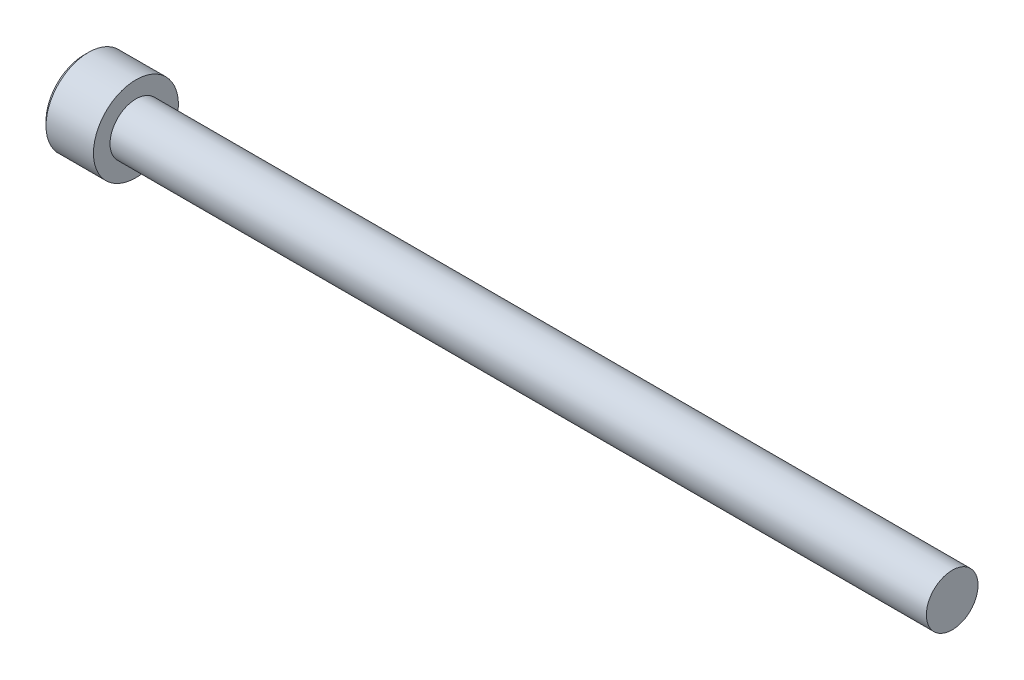
ISO-10303-21;
HEADER;
FILE_DESCRIPTION(('STEP AP214'),'2;1');
FILE_NAME('part.step','',(''),(''),'','','');
FILE_SCHEMA(('AUTOMOTIVE_DESIGN { 1 0 10303 214 1 1 1 1 }'));
ENDSEC;
DATA;
#1=APPLICATION_CONTEXT('core data for automotive mechanical design processes');
#2=APPLICATION_PROTOCOL_DEFINITION('international standard','automotive_design',2000,#1);
#3=PRODUCT_CONTEXT('',#1,'mechanical');
#4=PRODUCT('Part','Part','',(#3));
#5=PRODUCT_RELATED_PRODUCT_CATEGORY('part','',(#4));
#6=PRODUCT_DEFINITION_FORMATION('','',#4);
#7=PRODUCT_DEFINITION_CONTEXT('part definition',#1,'design');
#8=PRODUCT_DEFINITION('design','',#6,#7);
#9=PRODUCT_DEFINITION_SHAPE('','',#8);
#10=(LENGTH_UNIT() NAMED_UNIT(*) SI_UNIT(.MILLI.,.METRE.));
#11=(NAMED_UNIT(*) PLANE_ANGLE_UNIT() SI_UNIT($,.RADIAN.));
#12=(NAMED_UNIT(*) SI_UNIT($,.STERADIAN.) SOLID_ANGLE_UNIT());
#13=UNCERTAINTY_MEASURE_WITH_UNIT(LENGTH_MEASURE(1.E-05),#10,'distance_accuracy_value','');
#14=(GEOMETRIC_REPRESENTATION_CONTEXT(3) GLOBAL_UNCERTAINTY_ASSIGNED_CONTEXT((#13)) GLOBAL_UNIT_ASSIGNED_CONTEXT((#10,
#11,#12)) REPRESENTATION_CONTEXT('',''));
#15=CARTESIAN_POINT('',(0.,0.,0.));
#16=DIRECTION('',(0.,0.,1.));
#17=DIRECTION('',(1.,0.,0.));
#18=AXIS2_PLACEMENT_3D('',#15,#16,#17);
#19=CARTESIAN_POINT('',(-2.28600000000007,-1.14567944042317,1.984375));
#20=DIRECTION('',(0.,0.,1.));
#21=DIRECTION('',(1.,0.,0.));
#22=AXIS2_PLACEMENT_3D('',#19,#20,#21);
#23=PLANE('',#22);
#24=CARTESIAN_POINT('',(-4.82599999995852,1.14567944044653,1.98437499999554));
#25=CARTESIAN_POINT('',(-4.78691618362732,1.06743880343266,1.9843749999984));
#26=CARTESIAN_POINT('',(-4.75011447684892,0.987898318960917,1.98437499999957));
#27=CARTESIAN_POINT('',(-4.68265620500518,0.825677042028778,1.98437500000043));
#28=CARTESIAN_POINT('',(-4.65204056061138,0.742979382529199,1.98437500000012));
#29=CARTESIAN_POINT('',(-4.5991739228306,0.575193959555969,1.98437499999988));
#30=CARTESIAN_POINT('',(-4.57689462080725,0.490115359117279,1.98437499999997));
#31=CARTESIAN_POINT('',(-4.54259467221837,0.318093091130193,1.98437500000003));
#32=CARTESIAN_POINT('',(-4.5305423022885,0.231156054976726,1.984375));
#33=CARTESIAN_POINT('',(-4.52249110263747,0.119918521511051,1.984375));
#34=CARTESIAN_POINT('',(-4.52118947557477,0.0959468443046798,1.984375));
#35=CARTESIAN_POINT('',(-4.51945182629813,0.0479845644411998,1.984375));
#36=CARTESIAN_POINT('',(-4.51901533386223,0.0239939791589393,1.984375));
#37=CARTESIAN_POINT('',(-4.51901809008399,-0.0602201717457363,1.984375));
#38=CARTESIAN_POINT('',(-4.52177452299902,-0.120461721905447,1.984375));
#39=CARTESIAN_POINT('',(-4.5326365512493,-0.240474970989197,1.984375));
#40=CARTESIAN_POINT('',(-4.54074587749718,-0.300246312758427,1.984375));
#41=CARTESIAN_POINT('',(-4.57259622946939,-0.478763752804282,1.984375));
#42=CARTESIAN_POINT('',(-4.60385422611702,-0.596208828937734,1.984375));
#43=CARTESIAN_POINT('',(-4.66780003592237,-0.785921487441256,1.984375));
#44=CARTESIAN_POINT('',(-4.69623457768558,-0.859734609866899,1.984375));
#45=CARTESIAN_POINT('',(-4.75786140400812,-1.00456595519282,1.984375));
#46=CARTESIAN_POINT('',(-4.79100779300359,-1.07560356657101,1.984375));
#47=CARTESIAN_POINT('',(-4.82599999995643,-1.14567944044724,1.984375));
#48=B_SPLINE_CURVE_WITH_KNOTS('',3,(#24,#25,#26,#27,#28,#29,#30,#31,#32,#33,#34,#35,#36,#37,#38,
#39,#40,#41,#42,#43,#44,#45,#46,#47),.UNSPECIFIED.,.F.,.F.,(4,2,2,2,2,2,2,2,2,2,2,4),(0.,
0.262559005207405,0.526801735838036,0.790138824405318,1.05265603861765,1.12466619182083,
1.19663719499031,1.3772702672652,1.55802937209382,1.92104085090328,2.15819130092264,
2.39317265078575),.UNSPECIFIED.);
#49=CARTESIAN_POINT('',(-4.82599999996829,1.14567944041753,1.98437500003084));
#50=VERTEX_POINT('',#49);
#51=CARTESIAN_POINT('',(-4.8259999999622,-1.14567944043207,1.98437500001542));
#52=VERTEX_POINT('',#51);
#53=EDGE_CURVE('E20',#50,#52,#48,.T.);
#54=ORIENTED_EDGE('',*,*,#53,.F.);
#55=DIRECTION('',(1.,0.,0.));
#56=VECTOR('',#55,1.);
#57=CARTESIAN_POINT('',(-2.28600000000007,1.14567944042316,1.984375));
#58=LINE('',#57,#56);
#59=CARTESIAN_POINT('',(-2.28600000000007,1.14567944042316,1.984375));
#60=VERTEX_POINT('',#59);
#61=EDGE_CURVE('E68',#50,#60,#58,.T.);
#62=ORIENTED_EDGE('',*,*,#61,.T.);
#63=DIRECTION('',(0.,1.,0.));
#64=VECTOR('',#63,1.);
#65=CARTESIAN_POINT('',(-2.28600000000007,0.,1.984375));
#66=LINE('',#65,#64);
#67=CARTESIAN_POINT('',(-2.28600000000007,-1.14567944042317,1.984375));
#68=VERTEX_POINT('',#67);
#69=EDGE_CURVE('E74',#68,#60,#66,.T.);
#70=ORIENTED_EDGE('',*,*,#69,.F.);
#71=DIRECTION('',(1.,0.,0.));
#72=VECTOR('',#71,1.);
#73=CARTESIAN_POINT('',(-2.28600000000007,-1.14567944042317,1.984375));
#74=LINE('',#73,#72);
#75=EDGE_CURVE('E71',#68,#52,#74,.F.);
#76=ORIENTED_EDGE('',*,*,#75,.T.);
#77=EDGE_LOOP('',(#54,#62,#70,#76));
#78=FACE_BOUND('',#77,.T.);
#79=ADVANCED_FACE('F16',(#78),#23,.F.);
#80=CARTESIAN_POINT('',(-2.28600000000007,0.,0.));
#81=DIRECTION('',(-1.,0.,0.));
#82=DIRECTION('',(0.,0.,1.));
#83=AXIS2_PLACEMENT_3D('',#80,#81,#82);
#84=PLANE('',#83);
#85=DIRECTION('',(0.,0.5,0.866025403784439));
#86=VECTOR('',#85,1.);
#87=CARTESIAN_POINT('',(-2.28600000000007,2.29135888084633,0.));
#88=LINE('',#87,#86);
#89=CARTESIAN_POINT('',(-2.28600000000007,2.29135888084633,0.));
#90=VERTEX_POINT('',#89);
#91=CARTESIAN_POINT('',(-2.28600000000007,1.14567944042316,-1.984375));
#92=VERTEX_POINT('',#91);
#93=EDGE_CURVE('E82',#90,#92,#88,.F.);
#94=ORIENTED_EDGE('',*,*,#93,.T.);
#95=DIRECTION('',(0.,1.,0.));
#96=VECTOR('',#95,1.);
#97=CARTESIAN_POINT('',(-2.28600000000007,1.14567944042316,-1.984375));
#98=LINE('',#97,#96);
#99=CARTESIAN_POINT('',(-2.28600000000007,-1.14567944042316,-1.984375));
#100=VERTEX_POINT('',#99);
#101=EDGE_CURVE('E242',#92,#100,#98,.F.);
#102=ORIENTED_EDGE('',*,*,#101,.T.);
#103=DIRECTION('',(0.,0.5,-0.866025403784439));
#104=VECTOR('',#103,1.);
#105=CARTESIAN_POINT('',(-2.28600000000007,-1.14567944042316,-1.984375));
#106=LINE('',#105,#104);
#107=CARTESIAN_POINT('',(-2.28600000000007,-2.29135888084633,0.));
#108=VERTEX_POINT('',#107);
#109=EDGE_CURVE('E227',#100,#108,#106,.F.);
#110=ORIENTED_EDGE('',*,*,#109,.T.);
#111=DIRECTION('',(0.,-0.5,-0.866025403784439));
#112=VECTOR('',#111,1.);
#113=CARTESIAN_POINT('',(-2.28600000000007,-2.29135888084633,0.));
#114=LINE('',#113,#112);
#115=EDGE_CURVE('E224',#108,#68,#114,.F.);
#116=ORIENTED_EDGE('',*,*,#115,.T.);
#117=ORIENTED_EDGE('',*,*,#69,.T.);
#118=DIRECTION('',(0.,-0.5,0.866025403784439));
#119=VECTOR('',#118,1.);
#120=CARTESIAN_POINT('',(-2.28600000000007,1.14567944042316,1.984375));
#121=LINE('',#120,#119);
#122=EDGE_CURVE('E81',#60,#90,#121,.F.);
#123=ORIENTED_EDGE('',*,*,#122,.T.);
#124=EDGE_LOOP('',(#94,#102,#110,#116,#117,#123));
#125=FACE_BOUND('',#124,.T.);
#126=ADVANCED_FACE('F160',(#125),#84,.T.);
#127=CARTESIAN_POINT('',(-2.28600000000007,-1.14567944042316,-1.984375));
#128=DIRECTION('',(0.,-0.866025403784439,-0.5));
#129=DIRECTION('',(0.,0.5,-0.866025403784439));
#130=AXIS2_PLACEMENT_3D('',#127,#128,#129);
#131=PLANE('',#130);
#132=CARTESIAN_POINT('',(-4.82599999995871,-1.14567944040756,-1.98437500001887));
#133=CARTESIAN_POINT('',(-4.78666022792997,-1.18505700230148,-1.91617106214563));
#134=CARTESIAN_POINT('',(-4.74963132844072,-1.22509295783734,-1.8468267530301));
#135=CARTESIAN_POINT('',(-4.68183299424977,-1.30673037975396,-1.70542659047317));
#136=CARTESIAN_POINT('',(-4.65110127019237,-1.34833960561553,-1.63335729721673));
#137=CARTESIAN_POINT('',(-4.59845762010516,-1.432242568594,-1.48803310243203));
#138=CARTESIAN_POINT('',(-4.57641341195893,-1.47451494967301,-1.41481519064643));
#139=CARTESIAN_POINT('',(-4.54245011067441,-1.55999007976842,-1.26676792253773));
#140=CARTESIAN_POINT('',(-4.53050567471972,-1.6031902195197,-1.19194308559438));
#141=CARTESIAN_POINT('',(-4.51972842752365,-1.67764765054852,-1.06297903205139));
#142=CARTESIAN_POINT('',(-4.51813352794834,-1.70880881707173,-1.00900630841009));
#143=CARTESIAN_POINT('',(-4.52082392138599,-1.77108016542046,-0.901149169214274));
#144=CARTESIAN_POINT('',(-4.52511127545884,-1.80219032554946,-0.847264791239237));
#145=CARTESIAN_POINT('',(-4.53932219421538,-1.86411684097343,-0.740004920189235));
#146=CARTESIAN_POINT('',(-4.54925206045723,-1.8949328285454,-0.686630064029166));
#147=CARTESIAN_POINT('',(-4.5742029484467,-1.95603190279815,-0.580803363127978));
#148=CARTESIAN_POINT('',(-4.58922357974385,-1.98631503016081,-0.528351447923769));
#149=CARTESIAN_POINT('',(-4.63380478900425,-2.06386502548479,-0.394030915895904));
#150=CARTESIAN_POINT('',(-4.66672213384104,-2.11065153226583,-0.312994309042484));
#151=CARTESIAN_POINT('',(-4.72228952038986,-2.17944749410732,-0.193836207777459));
#152=CARTESIAN_POINT('',(-4.74181309375939,-2.20211890802843,-0.154568166986659));
#153=CARTESIAN_POINT('',(-4.78263970065987,-2.24704195201531,-0.0767591723707469));
#154=CARTESIAN_POINT('',(-4.80394164363173,-2.2692938292399,-0.0382177904539708));
#155=CARTESIAN_POINT('',(-4.82599999995675,-2.29135888085868,2.13931096265935E-11));
#156=B_SPLINE_CURVE_WITH_KNOTS('',3,(#132,#133,#134,#135,#136,#137,#138,#139,#140,#141,#142,
#143,#144,#145,#146,#147,#148,#149,#150,#151,#152,#153,#154,#155),.UNSPECIFIED.,.F.,.F.,(4,2,2,
2,2,2,2,2,2,2,2,4),(0.,0.264284909626495,0.530108996358094,0.791712695414128,1.05265800174404,
1.23942150116703,1.42625045663858,1.61328847394198,1.80031214908683,2.09727151182814,
2.24534838946042,2.39333511890876),.UNSPECIFIED.);
#157=CARTESIAN_POINT('',(-4.8259999999622,-1.14567944043207,-1.98437500001542));
#158=VERTEX_POINT('',#157);
#159=CARTESIAN_POINT('',(-4.82599999996846,-2.2913588808704,-2.00043543490866E-11));
#160=VERTEX_POINT('',#159);
#161=EDGE_CURVE('E162',#158,#160,#156,.T.);
#162=ORIENTED_EDGE('',*,*,#161,.T.);
#163=DIRECTION('',(1.,0.,0.));
#164=VECTOR('',#163,1.);
#165=CARTESIAN_POINT('',(-2.28600000000007,-2.29135888084633,0.));
#166=LINE('',#165,#164);
#167=EDGE_CURVE('E235',#160,#108,#166,.T.);
#168=ORIENTED_EDGE('',*,*,#167,.T.);
#169=ORIENTED_EDGE('',*,*,#109,.F.);
#170=DIRECTION('',(-1.,0.,0.));
#171=VECTOR('',#170,1.);
#172=CARTESIAN_POINT('',(-2.28600000000007,-1.14567944042316,-1.984375));
#173=LINE('',#172,#171);
#174=EDGE_CURVE('E245',#100,#158,#173,.T.);
#175=ORIENTED_EDGE('',*,*,#174,.T.);
#176=EDGE_LOOP('',(#162,#168,#169,#175));
#177=FACE_BOUND('',#176,.T.);
#178=ADVANCED_FACE('F156',(#177),#131,.F.);
#179=CARTESIAN_POINT('',(-2.28600000000007,-2.29135888084633,0.));
#180=DIRECTION('',(0.,-0.866025403784439,0.5));
#181=DIRECTION('',(0.,-0.5,-0.866025403784439));
#182=AXIS2_PLACEMENT_3D('',#179,#180,#181);
#183=PLANE('',#182);
#184=CARTESIAN_POINT('',(-4.8259999999587,-2.29135888085486,-2.29477011545215E-11));
#185=CARTESIAN_POINT('',(-4.78666022792997,-2.25198131896546,0.0682039378529047));
#186=CARTESIAN_POINT('',(-4.74963132844072,-2.21194536343147,0.137548246969502));
#187=CARTESIAN_POINT('',(-4.68183299424977,-2.13030794151622,0.278948409527228));
#188=CARTESIAN_POINT('',(-4.65110127019237,-2.08869871565414,0.351017702783377));
#189=CARTESIAN_POINT('',(-4.59845762010516,-2.00479575267531,0.496341897567867));
#190=CARTESIAN_POINT('',(-4.57641341195893,-1.96252337159644,0.569559809353539));
#191=CARTESIAN_POINT('',(-4.5424501106744,-1.87704824150112,0.717607077462299));
#192=CARTESIAN_POINT('',(-4.53050567471972,-1.8338481017498,0.792431914405622));
#193=CARTESIAN_POINT('',(-4.51972842752365,-1.75939067072096,0.921395967948603));
#194=CARTESIAN_POINT('',(-4.51813352794834,-1.72822950419776,0.975368691589913));
#195=CARTESIAN_POINT('',(-4.52082392138599,-1.66595815584903,1.08322583078573));
#196=CARTESIAN_POINT('',(-4.52511127545884,-1.63484799572003,1.13711020876076));
#197=CARTESIAN_POINT('',(-4.53932219421538,-1.57292148029607,1.24437007981077));
#198=CARTESIAN_POINT('',(-4.54925206045723,-1.54210549272409,1.29774493597084));
#199=CARTESIAN_POINT('',(-4.5742029484467,-1.48100641847134,1.40357163687202));
#200=CARTESIAN_POINT('',(-4.58922357974385,-1.45072329110868,1.45602355207623));
#201=CARTESIAN_POINT('',(-4.63380478900421,-1.37317329578476,1.59034408410398));
#202=CARTESIAN_POINT('',(-4.66672213384095,-1.32638678900379,1.6713806909573));
#203=CARTESIAN_POINT('',(-4.72228952038968,-1.25759082716239,1.79053879222216));
#204=CARTESIAN_POINT('',(-4.74181309375917,-1.23491941324131,1.82980683301291));
#205=CARTESIAN_POINT('',(-4.78263970065959,-1.18999636925449,1.90761582762873));
#206=CARTESIAN_POINT('',(-4.8039416436314,-1.16774449202993,1.94615720954545));
#207=CARTESIAN_POINT('',(-4.82599999995639,-1.14567944041117,1.98437500002077));
#208=B_SPLINE_CURVE_WITH_KNOTS('',3,(#184,#185,#186,#187,#188,#189,#190,#191,#192,#193,#194,
#195,#196,#197,#198,#199,#200,#201,#202,#203,#204,#205,#206,#207),.UNSPECIFIED.,.F.,.F.,(4,2,2,
2,2,2,2,2,2,2,2,4),(0.,0.264284909626493,0.530108996358089,0.791712695414125,1.05265800174404,
1.23942150116703,1.42625045663858,1.61328847394198,1.80031214908683,2.09727151182773,
2.24534838945981,2.39333511890795),.UNSPECIFIED.);
#209=EDGE_CURVE('E91',#160,#52,#208,.T.);
#210=ORIENTED_EDGE('',*,*,#209,.T.);
#211=ORIENTED_EDGE('',*,*,#75,.F.);
#212=ORIENTED_EDGE('',*,*,#115,.F.);
#213=ORIENTED_EDGE('',*,*,#167,.F.);
#214=EDGE_LOOP('',(#210,#211,#212,#213));
#215=FACE_BOUND('',#214,.T.);
#216=ADVANCED_FACE('F151',(#215),#183,.F.);
#217=CARTESIAN_POINT('',(-2.28600000000007,1.14567944042316,1.984375));
#218=DIRECTION('',(0.,0.866025403784439,0.5));
#219=DIRECTION('',(0.,-0.5,0.866025403784439));
#220=AXIS2_PLACEMENT_3D('',#217,#218,#219);
#221=PLANE('',#220);
#222=CARTESIAN_POINT('',(-4.82599999995852,1.14567944040762,1.98437500001801));
#223=CARTESIAN_POINT('',(-4.78666022792973,1.1850570023017,1.91617106214498));
#224=CARTESIAN_POINT('',(-4.74963132844047,1.22509295783761,1.84682675302957));
#225=CARTESIAN_POINT('',(-4.68183299424957,1.30673037975422,1.70542659047278));
#226=CARTESIAN_POINT('',(-4.65110127019222,1.34833960561574,1.63335729721638));
#227=CARTESIAN_POINT('',(-4.59845762010509,1.43224256859413,1.48803310243178));
#228=CARTESIAN_POINT('',(-4.57641341195888,1.47451494967311,1.41481519064625));
#229=CARTESIAN_POINT('',(-4.54245011067439,1.55999007976846,1.26676792253767));
#230=CARTESIAN_POINT('',(-4.53050567471972,1.6031902195197,1.19194308559439));
#231=CARTESIAN_POINT('',(-4.51972842752365,1.67764765054848,1.06297903205146));
#232=CARTESIAN_POINT('',(-4.51813352794835,1.70880881707169,1.00900630841016));
#233=CARTESIAN_POINT('',(-4.52082392138598,1.77108016542041,0.901149169214364));
#234=CARTESIAN_POINT('',(-4.52511127545883,1.80219032554941,0.847264791239333));
#235=CARTESIAN_POINT('',(-4.53932219421536,1.86411684097336,0.740004920189342));
#236=CARTESIAN_POINT('',(-4.54925206045721,1.89493282854533,0.686630064029278));
#237=CARTESIAN_POINT('',(-4.57420294844667,1.95603190279808,0.5808033631281));
#238=CARTESIAN_POINT('',(-4.58922357974382,1.98631503016074,0.528351447923897));
#239=CARTESIAN_POINT('',(-4.6338047890042,2.06386502548473,0.394030915896012));
#240=CARTESIAN_POINT('',(-4.666722133841,2.11065153226578,0.312994309042568));
#241=CARTESIAN_POINT('',(-4.72228952038984,2.17944749410729,0.19383620777751));
#242=CARTESIAN_POINT('',(-4.74181309375937,2.20211890802841,0.1545681669867));
#243=CARTESIAN_POINT('',(-4.78263970065986,2.24704195201529,0.0767591723707674));
#244=CARTESIAN_POINT('',(-4.80394164363172,2.26929382923989,0.0382177904539813));
#245=CARTESIAN_POINT('',(-4.82599999995675,2.29135888085868,-2.1392886942985E-11));
#246=B_SPLINE_CURVE_WITH_KNOTS('',3,(#222,#223,#224,#225,#226,#227,#228,#229,#230,#231,#232,
#233,#234,#235,#236,#237,#238,#239,#240,#241,#242,#243,#244,#245),.UNSPECIFIED.,.F.,.F.,(4,2,2,
2,2,2,2,2,2,2,2,4),(0.,0.26428490962629,0.530108996357672,0.791712695413487,1.05265800174319,
1.23942150116616,1.42625045663768,1.61328847394106,1.80031214908589,2.09727151182728,
2.2453483894596,2.39333511890798),.UNSPECIFIED.);
#247=CARTESIAN_POINT('',(-4.82599999996846,2.29135888087039,2.00042061038936E-11));
#248=VERTEX_POINT('',#247);
#249=EDGE_CURVE('E79',#50,#248,#246,.T.);
#250=ORIENTED_EDGE('',*,*,#249,.T.);
#251=DIRECTION('',(1.,0.,0.));
#252=VECTOR('',#251,1.);
#253=CARTESIAN_POINT('',(-2.28600000000007,2.29135888084633,0.));
#254=LINE('',#253,#252);
#255=EDGE_CURVE('E246',#248,#90,#254,.T.);
#256=ORIENTED_EDGE('',*,*,#255,.T.);
#257=ORIENTED_EDGE('',*,*,#122,.F.);
#258=ORIENTED_EDGE('',*,*,#61,.F.);
#259=EDGE_LOOP('',(#250,#256,#257,#258));
#260=FACE_BOUND('',#259,.T.);
#261=ADVANCED_FACE('F76',(#260),#221,.F.);
#262=CARTESIAN_POINT('',(-2.28600000000007,2.29135888084633,0.));
#263=DIRECTION('',(0.,0.866025403784439,-0.5));
#264=DIRECTION('',(0.,0.5,0.866025403784439));
#265=AXIS2_PLACEMENT_3D('',#262,#263,#264);
#266=PLANE('',#265);
#267=CARTESIAN_POINT('',(-4.82599999995871,2.29135888085486,2.29489280696874E-11));
#268=CARTESIAN_POINT('',(-4.78666022792997,2.25198131896547,-0.0682039378529039));
#269=CARTESIAN_POINT('',(-4.74963132844072,2.21194536343147,-0.137548246969502));
#270=CARTESIAN_POINT('',(-4.68183299424977,2.13030794151622,-0.278948409527229));
#271=CARTESIAN_POINT('',(-4.65110127019237,2.08869871565414,-0.351017702783379));
#272=CARTESIAN_POINT('',(-4.59845762010516,2.00479575267531,-0.496341897567869));
#273=CARTESIAN_POINT('',(-4.57641341195893,1.96252337159644,-0.569559809353541));
#274=CARTESIAN_POINT('',(-4.5424501106744,1.87704824150112,-0.7176070774623));
#275=CARTESIAN_POINT('',(-4.53050567471972,1.8338481017498,-0.792431914405622));
#276=CARTESIAN_POINT('',(-4.51972842752365,1.75939067072096,-0.921395967948603));
#277=CARTESIAN_POINT('',(-4.51813352794834,1.72822950419776,-0.975368691589912));
#278=CARTESIAN_POINT('',(-4.52082392138599,1.66595815584903,-1.08322583078573));
#279=CARTESIAN_POINT('',(-4.52511127545884,1.63484799572003,-1.13711020876076));
#280=CARTESIAN_POINT('',(-4.53932219421538,1.57292148029607,-1.24437007981077));
#281=CARTESIAN_POINT('',(-4.54925206045723,1.54210549272409,-1.29774493597083));
#282=CARTESIAN_POINT('',(-4.5742029484467,1.48100641847134,-1.40357163687202));
#283=CARTESIAN_POINT('',(-4.58922357974385,1.45072329110868,-1.45602355207623));
#284=CARTESIAN_POINT('',(-4.63380478900425,1.3731732957847,-1.5903440841041));
#285=CARTESIAN_POINT('',(-4.66672213384104,1.32638678900366,-1.67138069095752));
#286=CARTESIAN_POINT('',(-4.72228952038986,1.25759082716218,-1.79053879222254));
#287=CARTESIAN_POINT('',(-4.74181309375939,1.23491941324106,-1.82980683301334));
#288=CARTESIAN_POINT('',(-4.78263970065987,1.18999636925419,-1.90761582762925));
#289=CARTESIAN_POINT('',(-4.80394164363173,1.1677444920296,-1.94615720954603));
#290=CARTESIAN_POINT('',(-4.82599999995675,1.14567944041081,-1.98437500002139));
#291=B_SPLINE_CURVE_WITH_KNOTS('',3,(#267,#268,#269,#270,#271,#272,#273,#274,#275,#276,#277,
#278,#279,#280,#281,#282,#283,#284,#285,#286,#287,#288,#289,#290),.UNSPECIFIED.,.F.,.F.,(4,2,2,
2,2,2,2,2,2,2,2,4),(0.,0.264284909626495,0.530108996358093,0.791712695414127,1.05265800174404,
1.23942150116703,1.42625045663858,1.61328847394198,1.80031214908683,2.09727151182814,
2.24534838946042,2.39333511890876),.UNSPECIFIED.);
#292=CARTESIAN_POINT('',(-4.82599999996846,1.14567944045252,-1.98437500001084));
#293=VERTEX_POINT('',#292);
#294=EDGE_CURVE('E39',#248,#293,#291,.T.);
#295=ORIENTED_EDGE('',*,*,#294,.T.);
#296=DIRECTION('',(-1.,0.,0.));
#297=VECTOR('',#296,1.);
#298=CARTESIAN_POINT('',(-2.28600000000007,1.14567944042316,-1.984375));
#299=LINE('',#298,#297);
#300=EDGE_CURVE('E166',#293,#92,#299,.F.);
#301=ORIENTED_EDGE('',*,*,#300,.T.);
#302=ORIENTED_EDGE('',*,*,#93,.F.);
#303=ORIENTED_EDGE('',*,*,#255,.F.);
#304=EDGE_LOOP('',(#295,#301,#302,#303));
#305=FACE_BOUND('',#304,.T.);
#306=ADVANCED_FACE('F150',(#305),#266,.F.);
#307=CARTESIAN_POINT('',(-2.28600000000007,1.14567944042316,-1.984375));
#308=DIRECTION('',(0.,0.,-1.));
#309=DIRECTION('',(-1.,0.,0.));
#310=AXIS2_PLACEMENT_3D('',#307,#308,#309);
#311=PLANE('',#310);
#312=CARTESIAN_POINT('',(-4.8259999999587,1.14567944044731,-1.98437499999592));
#313=CARTESIAN_POINT('',(-4.78666022793094,1.06692431665146,-1.98437499999853));
#314=CARTESIAN_POINT('',(-4.74963132844318,0.986852405569011,-1.98437499999961));
#315=CARTESIAN_POINT('',(-4.6818329942566,0.823577561711963,-1.9843750000004));
#316=CARTESIAN_POINT('',(-4.65110127020207,0.740359109975722,-1.98437500000011));
#317=CARTESIAN_POINT('',(-4.59845762012233,0.572553183993917,-1.9843749999999));
#318=CARTESIAN_POINT('',(-4.57641341198063,0.488008421824127,-1.98437499999997));
#319=CARTESIAN_POINT('',(-4.54245011070673,0.317058161610178,-1.98437500000003));
#320=CARTESIAN_POINT('',(-4.53050567475816,0.230657882096267,-1.98437500000001));
#321=CARTESIAN_POINT('',(-4.51972842757294,0.0817430200124032,-1.984375));
#322=CARTESIAN_POINT('',(-4.51813352800283,0.0194206869508218,-1.984375));
#323=CARTESIAN_POINT('',(-4.52082392145254,-0.1051220097764,-1.984375));
#324=CARTESIAN_POINT('',(-4.52511127553227,-0.167342330049008,-1.984375));
#325=CARTESIAN_POINT('',(-4.53932219430377,-0.291195360925477,-1.984375));
#326=CARTESIAN_POINT('',(-4.54925206055372,-0.352827336083362,-1.984375));
#327=CARTESIAN_POINT('',(-4.57420294856008,-0.475025484616114,-1.984375));
#328=CARTESIAN_POINT('',(-4.58922357986604,-0.535591739354747,-1.984375));
#329=CARTESIAN_POINT('',(-4.63380478912724,-0.690691729958653,-1.984375));
#330=CARTESIAN_POINT('',(-4.66672213394715,-0.784264743465576,-1.984375));
#331=CARTESIAN_POINT('',(-4.7222895204619,-0.921856667069616,-1.984375));
#332=CARTESIAN_POINT('',(-4.74181309381856,-0.967199494886089,-1.984375));
#333=CARTESIAN_POINT('',(-4.78263970069104,-1.05704558280959,-1.984375));
#334=CARTESIAN_POINT('',(-4.80394164364776,-1.10154933723428,-1.984375));
#335=CARTESIAN_POINT('',(-4.82599999995675,-1.14567944044787,-1.984375));
#336=B_SPLINE_CURVE_WITH_KNOTS('',3,(#312,#313,#314,#315,#316,#317,#318,#319,#320,#321,#322,
#323,#324,#325,#326,#327,#328,#329,#330,#331,#332,#333,#334,#335),.UNSPECIFIED.,.F.,.F.,(4,2,2,
2,2,2,2,2,2,2,2,4),(0.,0.264284909658836,0.530108996422784,0.791712695509868,1.0526580018708,
1.23942150133878,1.42625045685537,1.61328847420389,1.80031214939384,2.09727151196384,
2.24534838950992,2.39333511887245),.UNSPECIFIED.);
#337=EDGE_CURVE('E108',#293,#158,#336,.T.);
#338=ORIENTED_EDGE('',*,*,#337,.T.);
#339=ORIENTED_EDGE('',*,*,#174,.F.);
#340=ORIENTED_EDGE('',*,*,#101,.F.);
#341=ORIENTED_EDGE('',*,*,#300,.F.);
#342=EDGE_LOOP('',(#338,#339,#340,#341));
#343=FACE_BOUND('',#342,.T.);
#344=ADVANCED_FACE('F121',(#343),#311,.F.);
#345=CARTESIAN_POINT('',(-4.82599999998001,0.,0.));
#346=DIRECTION('',(-1.,0.,0.));
#347=DIRECTION('',(0.,0.,1.));
#348=AXIS2_PLACEMENT_3D('',#345,#346,#347);
#349=CONICAL_SURFACE('',#348,2.29135888088194,0.785398163397448);
#350=ORIENTED_EDGE('',*,*,#161,.F.);
#351=CARTESIAN_POINT('',(-4.82599999998001,0.,0.));
#352=DIRECTION('',(-1.,0.,0.));
#353=DIRECTION('',(0.,0.,1.));
#354=AXIS2_PLACEMENT_3D('',#351,#352,#353);
#355=CIRCLE('',#354,2.29135888088194);
#356=EDGE_CURVE('E105',#158,#160,#355,.T.);
#357=ORIENTED_EDGE('',*,*,#356,.T.);
#358=EDGE_LOOP('',(#350,#357));
#359=FACE_BOUND('',#358,.T.);
#360=ADVANCED_FACE('F167',(#359),#349,.F.);
#361=CARTESIAN_POINT('',(-4.82599999998001,0.,0.));
#362=DIRECTION('',(-1.,0.,0.));
#363=DIRECTION('',(0.,0.,1.));
#364=AXIS2_PLACEMENT_3D('',#361,#362,#363);
#365=CONICAL_SURFACE('',#364,2.29135888088194,0.785398163397448);
#366=ORIENTED_EDGE('',*,*,#209,.F.);
#367=CARTESIAN_POINT('',(-4.82599999998001,0.,0.));
#368=DIRECTION('',(-1.,0.,0.));
#369=DIRECTION('',(0.,0.,1.));
#370=AXIS2_PLACEMENT_3D('',#367,#368,#369);
#371=CIRCLE('',#370,2.29135888088194);
#372=EDGE_CURVE('E86',#160,#52,#371,.T.);
#373=ORIENTED_EDGE('',*,*,#372,.T.);
#374=EDGE_LOOP('',(#366,#373));
#375=FACE_BOUND('',#374,.T.);
#376=ADVANCED_FACE('F170',(#375),#365,.F.);
#377=CARTESIAN_POINT('',(-4.82599999998001,0.,0.));
#378=DIRECTION('',(-1.,0.,0.));
#379=DIRECTION('',(0.,0.,1.));
#380=AXIS2_PLACEMENT_3D('',#377,#378,#379);
#381=CONICAL_SURFACE('',#380,2.29135888088194,0.78539816348948);
#382=CARTESIAN_POINT('',(-4.82599999998001,0.,0.));
#383=DIRECTION('',(-1.,0.,0.));
#384=DIRECTION('',(0.,0.,1.));
#385=AXIS2_PLACEMENT_3D('',#382,#383,#384);
#386=CIRCLE('',#385,2.29135888088194);
#387=EDGE_CURVE('E59',#52,#50,#386,.T.);
#388=ORIENTED_EDGE('',*,*,#387,.T.);
#389=ORIENTED_EDGE('',*,*,#53,.T.);
#390=EDGE_LOOP('',(#388,#389));
#391=FACE_BOUND('',#390,.T.);
#392=ADVANCED_FACE('F84',(#391),#381,.F.);
#393=CARTESIAN_POINT('',(-4.82599999998001,0.,0.));
#394=DIRECTION('',(-1.,0.,0.));
#395=DIRECTION('',(0.,0.,1.));
#396=AXIS2_PLACEMENT_3D('',#393,#394,#395);
#397=CONICAL_SURFACE('',#396,2.29135888088194,0.785398163397448);
#398=ORIENTED_EDGE('',*,*,#249,.F.);
#399=CARTESIAN_POINT('',(-4.82599999998001,0.,0.));
#400=DIRECTION('',(-1.,0.,0.));
#401=DIRECTION('',(0.,0.,1.));
#402=AXIS2_PLACEMENT_3D('',#399,#400,#401);
#403=CIRCLE('',#402,2.29135888088194);
#404=EDGE_CURVE('E85',#50,#248,#403,.T.);
#405=ORIENTED_EDGE('',*,*,#404,.T.);
#406=EDGE_LOOP('',(#398,#405));
#407=FACE_BOUND('',#406,.T.);
#408=ADVANCED_FACE('F90',(#407),#397,.F.);
#409=CARTESIAN_POINT('',(-4.82599999998001,0.,0.));
#410=DIRECTION('',(-1.,0.,0.));
#411=DIRECTION('',(0.,0.,1.));
#412=AXIS2_PLACEMENT_3D('',#409,#410,#411);
#413=CONICAL_SURFACE('',#412,2.29135888088194,0.785398163397448);
#414=ORIENTED_EDGE('',*,*,#294,.F.);
#415=CARTESIAN_POINT('',(-4.82599999998001,0.,0.));
#416=DIRECTION('',(-1.,0.,0.));
#417=DIRECTION('',(0.,0.,1.));
#418=AXIS2_PLACEMENT_3D('',#415,#416,#417);
#419=CIRCLE('',#418,2.29135888088194);
#420=EDGE_CURVE('E97',#248,#293,#419,.T.);
#421=ORIENTED_EDGE('',*,*,#420,.T.);
#422=EDGE_LOOP('',(#414,#421));
#423=FACE_BOUND('',#422,.T.);
#424=ADVANCED_FACE('F128',(#423),#413,.F.);
#425=CARTESIAN_POINT('',(-4.82599999998001,0.,0.));
#426=DIRECTION('',(-1.,0.,0.));
#427=DIRECTION('',(0.,0.,1.));
#428=AXIS2_PLACEMENT_3D('',#425,#426,#427);
#429=CONICAL_SURFACE('',#428,2.29135888088194,0.785398163489476);
#430=ORIENTED_EDGE('',*,*,#337,.F.);
#431=CARTESIAN_POINT('',(-4.82599999998001,0.,0.));
#432=DIRECTION('',(-1.,0.,0.));
#433=DIRECTION('',(0.,0.,1.));
#434=AXIS2_PLACEMENT_3D('',#431,#432,#433);
#435=CIRCLE('',#434,2.29135888088194);
#436=EDGE_CURVE('E99',#293,#158,#435,.T.);
#437=ORIENTED_EDGE('',*,*,#436,.T.);
#438=EDGE_LOOP('',(#430,#437));
#439=FACE_BOUND('',#438,.T.);
#440=ADVANCED_FACE('F124',(#439),#429,.F.);
#441=CARTESIAN_POINT('',(-4.82600000000007,0.,0.));
#442=DIRECTION('',(1.,0.,0.));
#443=DIRECTION('',(0.,0.,-1.));
#444=AXIS2_PLACEMENT_3D('',#441,#442,#443);
#445=PLANE('',#444);
#446=CARTESIAN_POINT('',(-4.82599999998001,0.,0.));
#447=DIRECTION('',(1.,0.,0.));
#448=DIRECTION('',(0.,0.,-1.));
#449=AXIS2_PLACEMENT_3D('',#446,#447,#448);
#450=CIRCLE('',#449,3.56615999999121);
#451=CARTESIAN_POINT('',(-4.82599999998001,0.,-3.56615999999121));
#452=VERTEX_POINT('',#451);
#453=EDGE_CURVE('E212',#452,#452,#450,.T.);
#454=ORIENTED_EDGE('',*,*,#453,.F.);
#455=EDGE_LOOP('',(#454));
#456=FACE_BOUND('',#455,.T.);
#457=ORIENTED_EDGE('',*,*,#420,.F.);
#458=ORIENTED_EDGE('',*,*,#404,.F.);
#459=ORIENTED_EDGE('',*,*,#387,.F.);
#460=ORIENTED_EDGE('',*,*,#372,.F.);
#461=ORIENTED_EDGE('',*,*,#356,.F.);
#462=ORIENTED_EDGE('',*,*,#436,.F.);
#463=EDGE_LOOP('',(#457,#458,#459,#460,#461,#462));
#464=FACE_BOUND('',#463,.T.);
#465=ADVANCED_FACE('F94',(#456,#464),#445,.F.);
#466=CARTESIAN_POINT('',(-4.42976000010731,0.,0.));
#467=DIRECTION('',(1.,0.,0.));
#468=DIRECTION('',(0.,0.,-1.));
#469=AXIS2_PLACEMENT_3D('',#466,#467,#468);
#470=CONICAL_SURFACE('',#469,3.96239999986392,0.785398163397448);
#471=CARTESIAN_POINT('',(-4.42976000000007,0.,0.));
#472=DIRECTION('',(-1.,0.,0.));
#473=DIRECTION('',(0.,0.,1.));
#474=AXIS2_PLACEMENT_3D('',#471,#472,#473);
#475=CIRCLE('',#474,3.9624);
#476=CARTESIAN_POINT('',(-4.42976000000007,0.,3.9624));
#477=VERTEX_POINT('',#476);
#478=EDGE_CURVE('E209',#477,#477,#475,.F.);
#479=ORIENTED_EDGE('',*,*,#478,.F.);
#480=EDGE_LOOP('',(#479));
#481=FACE_BOUND('',#480,.T.);
#482=ORIENTED_EDGE('',*,*,#453,.T.);
#483=EDGE_LOOP('',(#482));
#484=FACE_BOUND('',#483,.T.);
#485=ADVANCED_FACE('F198',(#481,#484),#470,.T.);
#486=CARTESIAN_POINT('',(-4.82600000000008,0.,0.));
#487=DIRECTION('',(-1.,0.,0.));
#488=DIRECTION('',(0.,0.,1.));
#489=AXIS2_PLACEMENT_3D('',#486,#487,#488);
#490=CYLINDRICAL_SURFACE('',#489,3.9624);
#491=ORIENTED_EDGE('',*,*,#478,.T.);
#492=EDGE_LOOP('',(#491));
#493=FACE_BOUND('',#492,.T.);
#494=CARTESIAN_POINT('',(0.,0.,0.));
#495=DIRECTION('',(-1.,0.,0.));
#496=DIRECTION('',(0.,0.,1.));
#497=AXIS2_PLACEMENT_3D('',#494,#495,#496);
#498=CIRCLE('',#497,3.9624);
#499=CARTESIAN_POINT('',(0.,0.,3.9624));
#500=VERTEX_POINT('',#499);
#501=EDGE_CURVE('E214',#500,#500,#498,.T.);
#502=ORIENTED_EDGE('',*,*,#501,.T.);
#503=EDGE_LOOP('',(#502));
#504=FACE_BOUND('',#503,.T.);
#505=ADVANCED_FACE('F195',(#493,#504),#490,.T.);
#506=CARTESIAN_POINT('',(76.2,0.,0.));
#507=DIRECTION('',(1.,0.,0.));
#508=DIRECTION('',(0.,0.,-1.));
#509=AXIS2_PLACEMENT_3D('',#506,#507,#508);
#510=PLANE('',#509);
#511=CARTESIAN_POINT('',(76.2,0.,0.));
#512=DIRECTION('',(-1.,0.,0.));
#513=DIRECTION('',(0.,0.,1.));
#514=AXIS2_PLACEMENT_3D('',#511,#512,#513);
#515=CIRCLE('',#514,2.413);
#516=CARTESIAN_POINT('',(76.2,0.,2.413));
#517=VERTEX_POINT('',#516);
#518=EDGE_CURVE('E30',#517,#517,#515,.T.);
#519=ORIENTED_EDGE('',*,*,#518,.F.);
#520=EDGE_LOOP('',(#519));
#521=FACE_BOUND('',#520,.T.);
#522=ADVANCED_FACE('F188',(#521),#510,.T.);
#523=CARTESIAN_POINT('',(0.,3.9624,0.));
#524=DIRECTION('',(-1.,0.,0.));
#525=DIRECTION('',(0.,0.,1.));
#526=AXIS2_PLACEMENT_3D('',#523,#524,#525);
#527=PLANE('',#526);
#528=CARTESIAN_POINT('',(0.,0.,0.));
#529=DIRECTION('',(-1.,0.,0.));
#530=DIRECTION('',(0.,0.,1.));
#531=AXIS2_PLACEMENT_3D('',#528,#529,#530);
#532=CIRCLE('',#531,2.413);
#533=CARTESIAN_POINT('',(0.,0.,2.413));
#534=VERTEX_POINT('',#533);
#535=EDGE_CURVE('E10',#534,#534,#532,.F.);
#536=ORIENTED_EDGE('',*,*,#535,.F.);
#537=EDGE_LOOP('',(#536));
#538=FACE_BOUND('',#537,.T.);
#539=ORIENTED_EDGE('',*,*,#501,.F.);
#540=EDGE_LOOP('',(#539));
#541=FACE_BOUND('',#540,.T.);
#542=ADVANCED_FACE('F182',(#538,#541),#527,.F.);
#543=CARTESIAN_POINT('',(76.2,0.,0.));
#544=DIRECTION('',(-1.,0.,0.));
#545=DIRECTION('',(0.,0.,1.));
#546=AXIS2_PLACEMENT_3D('',#543,#544,#545);
#547=CYLINDRICAL_SURFACE('',#546,2.413);
#548=ORIENTED_EDGE('',*,*,#535,.T.);
#549=EDGE_LOOP('',(#548));
#550=FACE_BOUND('',#549,.T.);
#551=ORIENTED_EDGE('',*,*,#518,.T.);
#552=EDGE_LOOP('',(#551));
#553=FACE_BOUND('',#552,.T.);
#554=ADVANCED_FACE('F180',(#550,#553),#547,.T.);
#555=CLOSED_SHELL('',(#79,#126,#178,#216,#261,#306,#344,#360,#376,#392,#408,#424,#440,#465,#485,
#505,#522,#542,#554));
#556=MANIFOLD_SOLID_BREP('B1',#555);
#557=ADVANCED_BREP_SHAPE_REPRESENTATION('',(#18,#556),#14);
#558=SHAPE_DEFINITION_REPRESENTATION(#9,#557);
ENDSEC;
END-ISO-10303-21;
